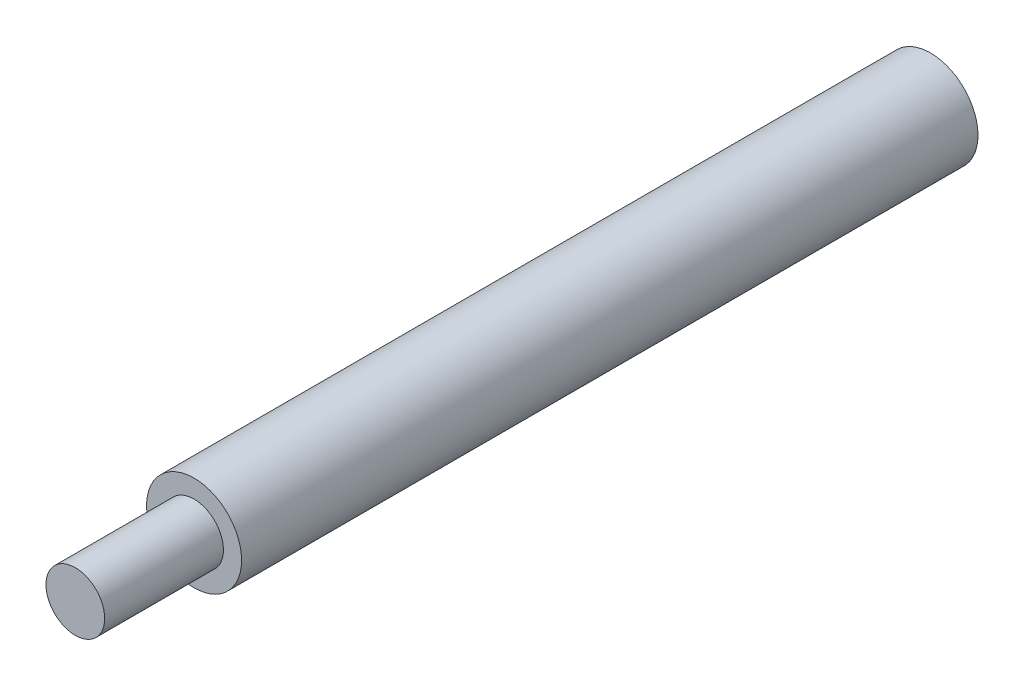
ISO-10303-21;
HEADER;
FILE_DESCRIPTION(('STEP AP214'),'2;1');
FILE_NAME('part.step','',(''),(''),'','','');
FILE_SCHEMA(('AUTOMOTIVE_DESIGN { 1 0 10303 214 1 1 1 1 }'));
ENDSEC;
DATA;
#1=APPLICATION_CONTEXT('core data for automotive mechanical design processes');
#2=APPLICATION_PROTOCOL_DEFINITION('international standard','automotive_design',2000,#1);
#3=PRODUCT_CONTEXT('',#1,'mechanical');
#4=PRODUCT('Part','Part','',(#3));
#5=PRODUCT_RELATED_PRODUCT_CATEGORY('part','',(#4));
#6=PRODUCT_DEFINITION_FORMATION('','',#4);
#7=PRODUCT_DEFINITION_CONTEXT('part definition',#1,'design');
#8=PRODUCT_DEFINITION('design','',#6,#7);
#9=PRODUCT_DEFINITION_SHAPE('','',#8);
#10=(LENGTH_UNIT() NAMED_UNIT(*) SI_UNIT(.MILLI.,.METRE.));
#11=(NAMED_UNIT(*) PLANE_ANGLE_UNIT() SI_UNIT($,.RADIAN.));
#12=(NAMED_UNIT(*) SI_UNIT($,.STERADIAN.) SOLID_ANGLE_UNIT());
#13=UNCERTAINTY_MEASURE_WITH_UNIT(LENGTH_MEASURE(1.E-05),#10,'distance_accuracy_value','');
#14=(GEOMETRIC_REPRESENTATION_CONTEXT(3) GLOBAL_UNCERTAINTY_ASSIGNED_CONTEXT((#13)) GLOBAL_UNIT_ASSIGNED_CONTEXT((#10,
#11,#12)) REPRESENTATION_CONTEXT('',''));
#15=CARTESIAN_POINT('',(0.,0.,0.));
#16=DIRECTION('',(0.,0.,1.));
#17=DIRECTION('',(1.,0.,0.));
#18=AXIS2_PLACEMENT_3D('',#15,#16,#17);
#19=CARTESIAN_POINT('',(0.,0.,62.));
#20=DIRECTION('',(0.,0.,-1.));
#21=DIRECTION('',(-1.,0.,0.));
#22=AXIS2_PLACEMENT_3D('',#19,#20,#21);
#23=CYLINDRICAL_SURFACE('',#22,4.);
#24=CARTESIAN_POINT('',(0.,0.,62.));
#25=DIRECTION('',(0.,0.,1.));
#26=DIRECTION('',(1.,0.,0.));
#27=AXIS2_PLACEMENT_3D('',#24,#25,#26);
#28=CIRCLE('',#27,4.);
#29=CARTESIAN_POINT('',(4.,0.,62.));
#30=VERTEX_POINT('',#29);
#31=EDGE_CURVE('E38',#30,#30,#28,.T.);
#32=ORIENTED_EDGE('',*,*,#31,.F.);
#33=EDGE_LOOP('',(#32));
#34=FACE_BOUND('',#33,.T.);
#35=CARTESIAN_POINT('',(0.,0.,0.));
#36=DIRECTION('',(0.,0.,1.));
#37=DIRECTION('',(1.,0.,0.));
#38=AXIS2_PLACEMENT_3D('',#35,#36,#37);
#39=CIRCLE('',#38,4.);
#40=CARTESIAN_POINT('',(4.,0.,0.));
#41=VERTEX_POINT('',#40);
#42=EDGE_CURVE('E34',#41,#41,#39,.T.);
#43=ORIENTED_EDGE('',*,*,#42,.T.);
#44=EDGE_LOOP('',(#43));
#45=FACE_BOUND('',#44,.T.);
#46=ADVANCED_FACE('F31',(#34,#45),#23,.T.);
#47=CARTESIAN_POINT('',(0.,0.,62.));
#48=DIRECTION('',(0.,0.,1.));
#49=DIRECTION('',(1.,0.,0.));
#50=AXIS2_PLACEMENT_3D('',#47,#48,#49);
#51=PLANE('',#50);
#52=CARTESIAN_POINT('',(0.,0.,62.));
#53=DIRECTION('',(0.,0.,1.));
#54=DIRECTION('',(1.,0.,0.));
#55=AXIS2_PLACEMENT_3D('',#52,#53,#54);
#56=CIRCLE('',#55,2.47169023824748);
#57=CARTESIAN_POINT('',(2.47169023824748,0.,62.));
#58=VERTEX_POINT('',#57);
#59=EDGE_CURVE('E10',#58,#58,#56,.T.);
#60=ORIENTED_EDGE('',*,*,#59,.F.);
#61=EDGE_LOOP('',(#60));
#62=FACE_BOUND('',#61,.T.);
#63=ORIENTED_EDGE('',*,*,#31,.T.);
#64=EDGE_LOOP('',(#63));
#65=FACE_BOUND('',#64,.T.);
#66=ADVANCED_FACE('F55',(#62,#65),#51,.T.);
#67=CARTESIAN_POINT('',(0.,0.,0.));
#68=DIRECTION('',(0.,0.,1.));
#69=DIRECTION('',(1.,0.,0.));
#70=AXIS2_PLACEMENT_3D('',#67,#68,#69);
#71=PLANE('',#70);
#72=ORIENTED_EDGE('',*,*,#42,.F.);
#73=EDGE_LOOP('',(#72));
#74=FACE_BOUND('',#73,.T.);
#75=ADVANCED_FACE('F52',(#74),#71,.F.);
#76=CARTESIAN_POINT('',(0.,0.,72.));
#77=DIRECTION('',(0.,0.,-1.));
#78=DIRECTION('',(-1.,0.,0.));
#79=AXIS2_PLACEMENT_3D('',#76,#77,#78);
#80=CYLINDRICAL_SURFACE('',#79,2.47169023824748);
#81=CARTESIAN_POINT('',(0.,0.,72.));
#82=DIRECTION('',(0.,0.,1.));
#83=DIRECTION('',(1.,0.,0.));
#84=AXIS2_PLACEMENT_3D('',#81,#82,#83);
#85=CIRCLE('',#84,2.47169023824748);
#86=CARTESIAN_POINT('',(2.47169023824748,0.,72.));
#87=VERTEX_POINT('',#86);
#88=EDGE_CURVE('E44',#87,#87,#85,.T.);
#89=ORIENTED_EDGE('',*,*,#88,.F.);
#90=EDGE_LOOP('',(#89));
#91=FACE_BOUND('',#90,.T.);
#92=ORIENTED_EDGE('',*,*,#59,.T.);
#93=EDGE_LOOP('',(#92));
#94=FACE_BOUND('',#93,.T.);
#95=ADVANCED_FACE('F54',(#91,#94),#80,.T.);
#96=CARTESIAN_POINT('',(0.,0.,72.));
#97=DIRECTION('',(0.,0.,1.));
#98=DIRECTION('',(1.,0.,0.));
#99=AXIS2_PLACEMENT_3D('',#96,#97,#98);
#100=PLANE('',#99);
#101=ORIENTED_EDGE('',*,*,#88,.T.);
#102=EDGE_LOOP('',(#101));
#103=FACE_BOUND('',#102,.T.);
#104=ADVANCED_FACE('F60',(#103),#100,.T.);
#105=CLOSED_SHELL('',(#46,#66,#75,#95,#104));
#106=MANIFOLD_SOLID_BREP('B2',#105);
#107=ADVANCED_BREP_SHAPE_REPRESENTATION('',(#18,#106),#14);
#108=SHAPE_DEFINITION_REPRESENTATION(#9,#107);
ENDSEC;
END-ISO-10303-21;
